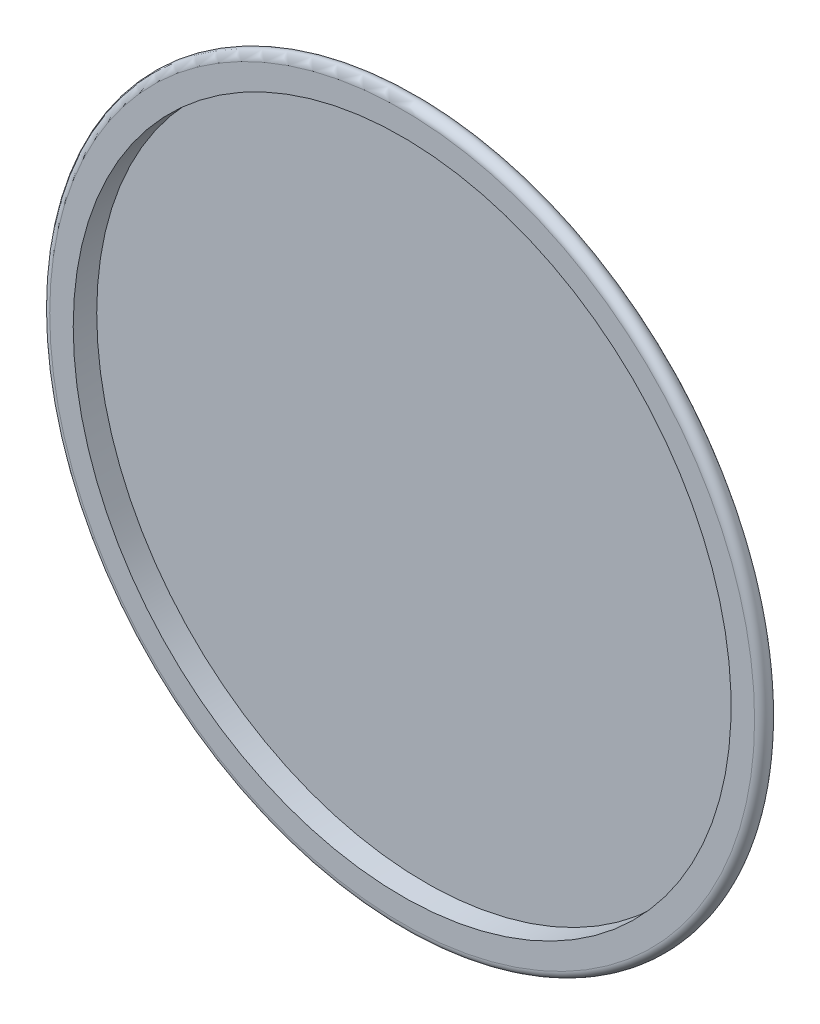
ISO-10303-21;
HEADER;
FILE_DESCRIPTION(('STEP AP214'),'2;1');
FILE_NAME('part.step','',(''),(''),'','','');
FILE_SCHEMA(('AUTOMOTIVE_DESIGN { 1 0 10303 214 1 1 1 1 }'));
ENDSEC;
DATA;
#1=APPLICATION_CONTEXT('core data for automotive mechanical design processes');
#2=APPLICATION_PROTOCOL_DEFINITION('international standard','automotive_design',2000,#1);
#3=PRODUCT_CONTEXT('',#1,'mechanical');
#4=PRODUCT('Part','Part','',(#3));
#5=PRODUCT_RELATED_PRODUCT_CATEGORY('part','',(#4));
#6=PRODUCT_DEFINITION_FORMATION('','',#4);
#7=PRODUCT_DEFINITION_CONTEXT('part definition',#1,'design');
#8=PRODUCT_DEFINITION('design','',#6,#7);
#9=PRODUCT_DEFINITION_SHAPE('','',#8);
#10=(LENGTH_UNIT() NAMED_UNIT(*) SI_UNIT(.MILLI.,.METRE.));
#11=(NAMED_UNIT(*) PLANE_ANGLE_UNIT() SI_UNIT($,.RADIAN.));
#12=(NAMED_UNIT(*) SI_UNIT($,.STERADIAN.) SOLID_ANGLE_UNIT());
#13=UNCERTAINTY_MEASURE_WITH_UNIT(LENGTH_MEASURE(1.E-05),#10,'distance_accuracy_value','');
#14=(GEOMETRIC_REPRESENTATION_CONTEXT(3) GLOBAL_UNCERTAINTY_ASSIGNED_CONTEXT((#13)) GLOBAL_UNIT_ASSIGNED_CONTEXT((#10,
#11,#12)) REPRESENTATION_CONTEXT('',''));
#15=CARTESIAN_POINT('',(0.,0.,0.));
#16=DIRECTION('',(0.,0.,1.));
#17=DIRECTION('',(1.,0.,0.));
#18=AXIS2_PLACEMENT_3D('',#15,#16,#17);
#19=CARTESIAN_POINT('',(0.,0.,-0.499999999999999));
#20=DIRECTION('',(0.,0.,-1.));
#21=DIRECTION('',(-1.,0.,0.));
#22=AXIS2_PLACEMENT_3D('',#19,#20,#21);
#23=TOROIDAL_SURFACE('',#22,22.5,0.499999999999998);
#24=CARTESIAN_POINT('',(0.,0.,-0.887580629734821));
#25=DIRECTION('',(0.,0.,-1.));
#26=DIRECTION('',(-1.,0.,0.));
#27=AXIS2_PLACEMENT_3D('',#24,#25,#26);
#28=CIRCLE('',#27,22.8158817111742);
#29=CARTESIAN_POINT('',(-22.8158817111742,0.,-0.887580629734821));
#30=VERTEX_POINT('',#29);
#31=EDGE_CURVE('E10',#30,#30,#28,.T.);
#32=ORIENTED_EDGE('',*,*,#31,.F.);
#33=EDGE_LOOP('',(#32));
#34=FACE_BOUND('',#33,.T.);
#35=CARTESIAN_POINT('',(0.,0.,0.));
#36=DIRECTION('',(0.,0.,-1.));
#37=DIRECTION('',(-1.,0.,0.));
#38=AXIS2_PLACEMENT_3D('',#35,#36,#37);
#39=CIRCLE('',#38,22.5);
#40=CARTESIAN_POINT('',(-22.5,0.,0.));
#41=VERTEX_POINT('',#40);
#42=EDGE_CURVE('E53',#41,#41,#39,.T.);
#43=ORIENTED_EDGE('',*,*,#42,.T.);
#44=EDGE_LOOP('',(#43));
#45=FACE_BOUND('',#44,.T.);
#46=ADVANCED_FACE('F34',(#34,#45),#23,.T.);
#47=CARTESIAN_POINT('',(0.,0.,2.98822566761341));
#48=DIRECTION('',(0.,0.,-1.));
#49=DIRECTION('',(-1.,0.,0.));
#50=AXIS2_PLACEMENT_3D('',#47,#48,#49);
#51=TOROIDAL_SURFACE('',#50,19.657064599432,5.);
#52=CARTESIAN_POINT('',(0.,0.,-2.));
#53=DIRECTION('',(0.,0.,-1.));
#54=DIRECTION('',(-1.,0.,0.));
#55=AXIS2_PLACEMENT_3D('',#52,#53,#54);
#56=CIRCLE('',#55,20.);
#57=CARTESIAN_POINT('',(-20.,0.,-2.));
#58=VERTEX_POINT('',#57);
#59=EDGE_CURVE('E40',#58,#58,#56,.T.);
#60=ORIENTED_EDGE('',*,*,#59,.F.);
#61=EDGE_LOOP('',(#60));
#62=FACE_BOUND('',#61,.T.);
#63=ORIENTED_EDGE('',*,*,#31,.T.);
#64=EDGE_LOOP('',(#63));
#65=FACE_BOUND('',#64,.T.);
#66=ADVANCED_FACE('F77',(#62,#65),#51,.T.);
#67=CARTESIAN_POINT('',(20.,0.,-2.));
#68=DIRECTION('',(0.,0.,1.));
#69=DIRECTION('',(1.,0.,0.));
#70=AXIS2_PLACEMENT_3D('',#67,#68,#69);
#71=PLANE('',#70);
#72=ORIENTED_EDGE('',*,*,#59,.T.);
#73=EDGE_LOOP('',(#72));
#74=FACE_BOUND('',#73,.T.);
#75=ADVANCED_FACE('F72',(#74),#71,.F.);
#76=CARTESIAN_POINT('',(21.,0.,-1.5));
#77=DIRECTION('',(0.,0.,-1.));
#78=DIRECTION('',(-1.,0.,0.));
#79=AXIS2_PLACEMENT_3D('',#76,#77,#78);
#80=PLANE('',#79);
#81=CARTESIAN_POINT('',(0.,0.,-1.5));
#82=DIRECTION('',(0.,0.,-1.));
#83=DIRECTION('',(-1.,0.,0.));
#84=AXIS2_PLACEMENT_3D('',#81,#82,#83);
#85=CIRCLE('',#84,21.);
#86=CARTESIAN_POINT('',(-21.,0.,-1.5));
#87=VERTEX_POINT('',#86);
#88=EDGE_CURVE('E44',#87,#87,#85,.T.);
#89=ORIENTED_EDGE('',*,*,#88,.F.);
#90=EDGE_LOOP('',(#89));
#91=FACE_BOUND('',#90,.T.);
#92=ADVANCED_FACE('F67',(#91),#80,.F.);
#93=CARTESIAN_POINT('',(0.,0.,-2.));
#94=DIRECTION('',(0.,0.,-1.));
#95=DIRECTION('',(-1.,0.,0.));
#96=AXIS2_PLACEMENT_3D('',#93,#94,#95);
#97=CYLINDRICAL_SURFACE('',#96,21.);
#98=CARTESIAN_POINT('',(0.,0.,0.));
#99=DIRECTION('',(0.,0.,-1.));
#100=DIRECTION('',(-1.,0.,0.));
#101=AXIS2_PLACEMENT_3D('',#98,#99,#100);
#102=CIRCLE('',#101,21.);
#103=CARTESIAN_POINT('',(-21.,0.,0.));
#104=VERTEX_POINT('',#103);
#105=EDGE_CURVE('E48',#104,#104,#102,.T.);
#106=ORIENTED_EDGE('',*,*,#105,.F.);
#107=EDGE_LOOP('',(#106));
#108=FACE_BOUND('',#107,.T.);
#109=ORIENTED_EDGE('',*,*,#88,.T.);
#110=EDGE_LOOP('',(#109));
#111=FACE_BOUND('',#110,.T.);
#112=ADVANCED_FACE('F61',(#108,#111),#97,.F.);
#113=CARTESIAN_POINT('',(21.,0.,0.));
#114=DIRECTION('',(0.,0.,-1.));
#115=DIRECTION('',(-1.,0.,0.));
#116=AXIS2_PLACEMENT_3D('',#113,#114,#115);
#117=PLANE('',#116);
#118=ORIENTED_EDGE('',*,*,#42,.F.);
#119=EDGE_LOOP('',(#118));
#120=FACE_BOUND('',#119,.T.);
#121=ORIENTED_EDGE('',*,*,#105,.T.);
#122=EDGE_LOOP('',(#121));
#123=FACE_BOUND('',#122,.T.);
#124=ADVANCED_FACE('F58',(#120,#123),#117,.F.);
#125=CLOSED_SHELL('',(#46,#66,#75,#92,#112,#124));
#126=MANIFOLD_SOLID_BREP('B2',#125);
#127=ADVANCED_BREP_SHAPE_REPRESENTATION('',(#18,#126),#14);
#128=SHAPE_DEFINITION_REPRESENTATION(#9,#127);
ENDSEC;
END-ISO-10303-21;
